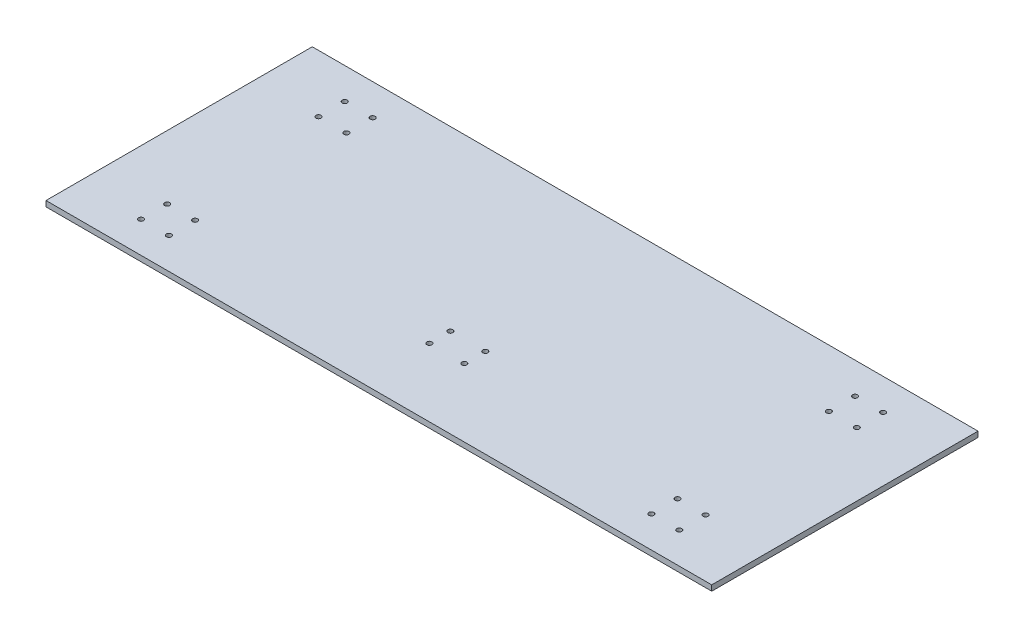
ISO-10303-21;
HEADER;
FILE_DESCRIPTION(('STEP AP214'),'2;1');
FILE_NAME('part.step','',(''),(''),'','','');
FILE_SCHEMA(('AUTOMOTIVE_DESIGN { 1 0 10303 214 1 1 1 1 }'));
ENDSEC;
DATA;
#1=APPLICATION_CONTEXT('core data for automotive mechanical design processes');
#2=APPLICATION_PROTOCOL_DEFINITION('international standard','automotive_design',2000,#1);
#3=PRODUCT_CONTEXT('',#1,'mechanical');
#4=PRODUCT('Part','Part','',(#3));
#5=PRODUCT_RELATED_PRODUCT_CATEGORY('part','',(#4));
#6=PRODUCT_DEFINITION_FORMATION('','',#4);
#7=PRODUCT_DEFINITION_CONTEXT('part definition',#1,'design');
#8=PRODUCT_DEFINITION('design','',#6,#7);
#9=PRODUCT_DEFINITION_SHAPE('','',#8);
#10=(LENGTH_UNIT() NAMED_UNIT(*) SI_UNIT(.MILLI.,.METRE.));
#11=(NAMED_UNIT(*) PLANE_ANGLE_UNIT() SI_UNIT($,.RADIAN.));
#12=(NAMED_UNIT(*) SI_UNIT($,.STERADIAN.) SOLID_ANGLE_UNIT());
#13=UNCERTAINTY_MEASURE_WITH_UNIT(LENGTH_MEASURE(1.E-05),#10,'distance_accuracy_value','');
#14=(GEOMETRIC_REPRESENTATION_CONTEXT(3) GLOBAL_UNCERTAINTY_ASSIGNED_CONTEXT((#13)) GLOBAL_UNIT_ASSIGNED_CONTEXT((#10,
#11,#12)) REPRESENTATION_CONTEXT('',''));
#15=CARTESIAN_POINT('',(0.,0.,0.));
#16=DIRECTION('',(0.,0.,1.));
#17=DIRECTION('',(1.,0.,0.));
#18=AXIS2_PLACEMENT_3D('',#15,#16,#17);
#19=CARTESIAN_POINT('',(381.,6.35,-152.4));
#20=DIRECTION('',(-1.,0.,0.));
#21=DIRECTION('',(0.,0.,1.));
#22=AXIS2_PLACEMENT_3D('',#19,#20,#21);
#23=PLANE('',#22);
#24=DIRECTION('',(0.,0.,-1.));
#25=VECTOR('',#24,1.);
#26=CARTESIAN_POINT('',(381.,0.,-152.4));
#27=LINE('',#26,#25);
#28=CARTESIAN_POINT('',(381.,0.,152.4));
#29=VERTEX_POINT('',#28);
#30=CARTESIAN_POINT('',(381.,0.,-152.4));
#31=VERTEX_POINT('',#30);
#32=EDGE_CURVE('E98',#29,#31,#27,.T.);
#33=ORIENTED_EDGE('',*,*,#32,.T.);
#34=DIRECTION('',(0.,-1.,0.));
#35=VECTOR('',#34,1.);
#36=CARTESIAN_POINT('',(381.,6.35,-152.4));
#37=LINE('',#36,#35);
#38=CARTESIAN_POINT('',(381.,6.35,-152.4));
#39=VERTEX_POINT('',#38);
#40=EDGE_CURVE('E11',#39,#31,#37,.T.);
#41=ORIENTED_EDGE('',*,*,#40,.F.);
#42=DIRECTION('',(0.,0.,-1.));
#43=VECTOR('',#42,1.);
#44=CARTESIAN_POINT('',(381.,6.35,-152.4));
#45=LINE('',#44,#43);
#46=CARTESIAN_POINT('',(381.,6.35,152.4));
#47=VERTEX_POINT('',#46);
#48=EDGE_CURVE('E86',#47,#39,#45,.T.);
#49=ORIENTED_EDGE('',*,*,#48,.F.);
#50=DIRECTION('',(0.,-1.,0.));
#51=VECTOR('',#50,1.);
#52=CARTESIAN_POINT('',(381.,6.35,152.4));
#53=LINE('',#52,#51);
#54=EDGE_CURVE('E94',#47,#29,#53,.T.);
#55=ORIENTED_EDGE('',*,*,#54,.T.);
#56=EDGE_LOOP('',(#33,#41,#49,#55));
#57=FACE_BOUND('',#56,.T.);
#58=ADVANCED_FACE('F35',(#57),#23,.F.);
#59=CARTESIAN_POINT('',(-381.,6.35,-152.4));
#60=DIRECTION('',(0.,0.,1.));
#61=DIRECTION('',(1.,0.,0.));
#62=AXIS2_PLACEMENT_3D('',#59,#60,#61);
#63=PLANE('',#62);
#64=DIRECTION('',(-1.,0.,0.));
#65=VECTOR('',#64,1.);
#66=CARTESIAN_POINT('',(-381.,0.,-152.4));
#67=LINE('',#66,#65);
#68=CARTESIAN_POINT('',(-381.,0.,-152.4));
#69=VERTEX_POINT('',#68);
#70=EDGE_CURVE('E90',#31,#69,#67,.T.);
#71=ORIENTED_EDGE('',*,*,#70,.T.);
#72=DIRECTION('',(0.,-1.,0.));
#73=VECTOR('',#72,1.);
#74=CARTESIAN_POINT('',(-381.,6.35,-152.4));
#75=LINE('',#74,#73);
#76=CARTESIAN_POINT('',(-381.,6.35,-152.4));
#77=VERTEX_POINT('',#76);
#78=EDGE_CURVE('E43',#77,#69,#75,.T.);
#79=ORIENTED_EDGE('',*,*,#78,.F.);
#80=DIRECTION('',(-1.,0.,0.));
#81=VECTOR('',#80,1.);
#82=CARTESIAN_POINT('',(-381.,6.35,-152.4));
#83=LINE('',#82,#81);
#84=EDGE_CURVE('E81',#39,#77,#83,.T.);
#85=ORIENTED_EDGE('',*,*,#84,.F.);
#86=ORIENTED_EDGE('',*,*,#40,.T.);
#87=EDGE_LOOP('',(#71,#79,#85,#86));
#88=FACE_BOUND('',#87,.T.);
#89=ADVANCED_FACE('F89',(#88),#63,.F.);
#90=CARTESIAN_POINT('',(-381.,6.35,-152.4));
#91=DIRECTION('',(1.,0.,0.));
#92=DIRECTION('',(0.,0.,-1.));
#93=AXIS2_PLACEMENT_3D('',#90,#91,#92);
#94=PLANE('',#93);
#95=DIRECTION('',(0.,0.,1.));
#96=VECTOR('',#95,1.);
#97=CARTESIAN_POINT('',(-381.,0.,-152.4));
#98=LINE('',#97,#96);
#99=CARTESIAN_POINT('',(-381.,0.,152.4));
#100=VERTEX_POINT('',#99);
#101=EDGE_CURVE('E68',#69,#100,#98,.T.);
#102=ORIENTED_EDGE('',*,*,#101,.T.);
#103=DIRECTION('',(0.,-1.,0.));
#104=VECTOR('',#103,1.);
#105=CARTESIAN_POINT('',(-381.,6.35,152.4));
#106=LINE('',#105,#104);
#107=CARTESIAN_POINT('',(-381.,6.35,152.4));
#108=VERTEX_POINT('',#107);
#109=EDGE_CURVE('E91',#108,#100,#106,.T.);
#110=ORIENTED_EDGE('',*,*,#109,.F.);
#111=DIRECTION('',(0.,0.,1.));
#112=VECTOR('',#111,1.);
#113=CARTESIAN_POINT('',(-381.,6.35,-152.4));
#114=LINE('',#113,#112);
#115=EDGE_CURVE('E84',#77,#108,#114,.T.);
#116=ORIENTED_EDGE('',*,*,#115,.F.);
#117=ORIENTED_EDGE('',*,*,#78,.T.);
#118=EDGE_LOOP('',(#102,#110,#116,#117));
#119=FACE_BOUND('',#118,.T.);
#120=ADVANCED_FACE('F92',(#119),#94,.F.);
#121=CARTESIAN_POINT('',(-381.,6.35,152.4));
#122=DIRECTION('',(0.,0.,-1.));
#123=DIRECTION('',(-1.,0.,0.));
#124=AXIS2_PLACEMENT_3D('',#121,#122,#123);
#125=PLANE('',#124);
#126=DIRECTION('',(1.,0.,0.));
#127=VECTOR('',#126,1.);
#128=CARTESIAN_POINT('',(-381.,0.,152.4));
#129=LINE('',#128,#127);
#130=EDGE_CURVE('E74',#100,#29,#129,.T.);
#131=ORIENTED_EDGE('',*,*,#130,.T.);
#132=ORIENTED_EDGE('',*,*,#54,.F.);
#133=DIRECTION('',(1.,0.,0.));
#134=VECTOR('',#133,1.);
#135=CARTESIAN_POINT('',(-381.,6.35,152.4));
#136=LINE('',#135,#134);
#137=EDGE_CURVE('E51',#108,#47,#136,.T.);
#138=ORIENTED_EDGE('',*,*,#137,.F.);
#139=ORIENTED_EDGE('',*,*,#109,.T.);
#140=EDGE_LOOP('',(#131,#132,#138,#139));
#141=FACE_BOUND('',#140,.T.);
#142=ADVANCED_FACE('F106',(#141),#125,.F.);
#143=CARTESIAN_POINT('',(0.,6.35,0.));
#144=DIRECTION('',(0.,1.,0.));
#145=DIRECTION('',(0.,0.,1.));
#146=AXIS2_PLACEMENT_3D('',#143,#144,#145);
#147=PLANE('',#146);
#148=CARTESIAN_POINT('',(276.100000000858,6.35,-116.6));
#149=DIRECTION('',(0.,1.,0.));
#150=DIRECTION('',(0.,0.,1.));
#151=AXIS2_PLACEMENT_3D('',#148,#149,#150);
#152=CIRCLE('',#151,2.90000000000001);
#153=CARTESIAN_POINT('',(276.100000000858,6.35,-113.7));
#154=VERTEX_POINT('',#153);
#155=EDGE_CURVE('E228',#154,#154,#152,.T.);
#156=ORIENTED_EDGE('',*,*,#155,.F.);
#157=EDGE_LOOP('',(#156));
#158=FACE_BOUND('',#157,.T.);
#159=CARTESIAN_POINT('',(276.100000000858,6.35,-86.6000000000002));
#160=DIRECTION('',(0.,1.,0.));
#161=DIRECTION('',(0.,0.,1.));
#162=AXIS2_PLACEMENT_3D('',#159,#160,#161);
#163=CIRCLE('',#162,2.90000000000001);
#164=CARTESIAN_POINT('',(276.100000000858,6.35,-83.7000000000001));
#165=VERTEX_POINT('',#164);
#166=EDGE_CURVE('E222',#165,#165,#163,.T.);
#167=ORIENTED_EDGE('',*,*,#166,.F.);
#168=EDGE_LOOP('',(#167));
#169=FACE_BOUND('',#168,.T.);
#170=CARTESIAN_POINT('',(308.100000000858,6.35,-116.6));
#171=DIRECTION('',(0.,1.,0.));
#172=DIRECTION('',(0.,0.,1.));
#173=AXIS2_PLACEMENT_3D('',#170,#171,#172);
#174=CIRCLE('',#173,2.90000000000001);
#175=CARTESIAN_POINT('',(308.100000000858,6.35,-113.7));
#176=VERTEX_POINT('',#175);
#177=EDGE_CURVE('E216',#176,#176,#174,.T.);
#178=ORIENTED_EDGE('',*,*,#177,.F.);
#179=EDGE_LOOP('',(#178));
#180=FACE_BOUND('',#179,.T.);
#181=CARTESIAN_POINT('',(308.100000000858,6.35,-86.6000000000002));
#182=DIRECTION('',(0.,1.,0.));
#183=DIRECTION('',(0.,0.,1.));
#184=AXIS2_PLACEMENT_3D('',#181,#182,#183);
#185=CIRCLE('',#184,2.90000000000001);
#186=CARTESIAN_POINT('',(308.100000000858,6.35,-83.7000000000001));
#187=VERTEX_POINT('',#186);
#188=EDGE_CURVE('E210',#187,#187,#185,.T.);
#189=ORIENTED_EDGE('',*,*,#188,.F.);
#190=EDGE_LOOP('',(#189));
#191=FACE_BOUND('',#190,.T.);
#192=CARTESIAN_POINT('',(276.100000000858,6.35,86.5999999999998));
#193=DIRECTION('',(0.,1.,0.));
#194=DIRECTION('',(0.,0.,1.));
#195=AXIS2_PLACEMENT_3D('',#192,#193,#194);
#196=CIRCLE('',#195,2.90000000000001);
#197=CARTESIAN_POINT('',(276.100000000858,6.35,89.4999999999998));
#198=VERTEX_POINT('',#197);
#199=EDGE_CURVE('E204',#198,#198,#196,.T.);
#200=ORIENTED_EDGE('',*,*,#199,.F.);
#201=EDGE_LOOP('',(#200));
#202=FACE_BOUND('',#201,.T.);
#203=CARTESIAN_POINT('',(276.100000000858,6.35,116.6));
#204=DIRECTION('',(0.,1.,0.));
#205=DIRECTION('',(0.,0.,1.));
#206=AXIS2_PLACEMENT_3D('',#203,#204,#205);
#207=CIRCLE('',#206,2.90000000000001);
#208=CARTESIAN_POINT('',(276.100000000858,6.35,119.5));
#209=VERTEX_POINT('',#208);
#210=EDGE_CURVE('E198',#209,#209,#207,.T.);
#211=ORIENTED_EDGE('',*,*,#210,.F.);
#212=EDGE_LOOP('',(#211));
#213=FACE_BOUND('',#212,.T.);
#214=CARTESIAN_POINT('',(308.100000000858,6.35,86.5999999999998));
#215=DIRECTION('',(0.,1.,0.));
#216=DIRECTION('',(0.,0.,1.));
#217=AXIS2_PLACEMENT_3D('',#214,#215,#216);
#218=CIRCLE('',#217,2.90000000000001);
#219=CARTESIAN_POINT('',(308.100000000858,6.35,89.4999999999998));
#220=VERTEX_POINT('',#219);
#221=EDGE_CURVE('E192',#220,#220,#218,.T.);
#222=ORIENTED_EDGE('',*,*,#221,.F.);
#223=EDGE_LOOP('',(#222));
#224=FACE_BOUND('',#223,.T.);
#225=CARTESIAN_POINT('',(308.100000000858,6.35,116.6));
#226=DIRECTION('',(0.,1.,0.));
#227=DIRECTION('',(0.,0.,1.));
#228=AXIS2_PLACEMENT_3D('',#225,#226,#227);
#229=CIRCLE('',#228,2.90000000000001);
#230=CARTESIAN_POINT('',(308.100000000858,6.35,119.5));
#231=VERTEX_POINT('',#230);
#232=EDGE_CURVE('E186',#231,#231,#229,.T.);
#233=ORIENTED_EDGE('',*,*,#232,.F.);
#234=EDGE_LOOP('',(#233));
#235=FACE_BOUND('',#234,.T.);
#236=CARTESIAN_POINT('',(-308.100000000858,6.35,-116.6));
#237=DIRECTION('',(0.,1.,0.));
#238=DIRECTION('',(0.,0.,1.));
#239=AXIS2_PLACEMENT_3D('',#236,#237,#238);
#240=CIRCLE('',#239,2.90000000000001);
#241=CARTESIAN_POINT('',(-308.100000000858,6.35,-113.7));
#242=VERTEX_POINT('',#241);
#243=EDGE_CURVE('E180',#242,#242,#240,.T.);
#244=ORIENTED_EDGE('',*,*,#243,.F.);
#245=EDGE_LOOP('',(#244));
#246=FACE_BOUND('',#245,.T.);
#247=CARTESIAN_POINT('',(-308.100000000858,6.35,-86.6000000000001));
#248=DIRECTION('',(0.,1.,0.));
#249=DIRECTION('',(0.,0.,1.));
#250=AXIS2_PLACEMENT_3D('',#247,#248,#249);
#251=CIRCLE('',#250,2.90000000000001);
#252=CARTESIAN_POINT('',(-308.100000000858,6.35,-83.7000000000001));
#253=VERTEX_POINT('',#252);
#254=EDGE_CURVE('E174',#253,#253,#251,.T.);
#255=ORIENTED_EDGE('',*,*,#254,.F.);
#256=EDGE_LOOP('',(#255));
#257=FACE_BOUND('',#256,.T.);
#258=CARTESIAN_POINT('',(-276.100000000858,6.35,-116.6));
#259=DIRECTION('',(0.,1.,0.));
#260=DIRECTION('',(0.,0.,1.));
#261=AXIS2_PLACEMENT_3D('',#258,#259,#260);
#262=CIRCLE('',#261,2.90000000000001);
#263=CARTESIAN_POINT('',(-276.100000000858,6.35,-113.7));
#264=VERTEX_POINT('',#263);
#265=EDGE_CURVE('E168',#264,#264,#262,.T.);
#266=ORIENTED_EDGE('',*,*,#265,.F.);
#267=EDGE_LOOP('',(#266));
#268=FACE_BOUND('',#267,.T.);
#269=CARTESIAN_POINT('',(-276.100000000858,6.35,-86.6000000000001));
#270=DIRECTION('',(0.,1.,0.));
#271=DIRECTION('',(0.,0.,1.));
#272=AXIS2_PLACEMENT_3D('',#269,#270,#271);
#273=CIRCLE('',#272,2.90000000000001);
#274=CARTESIAN_POINT('',(-276.100000000858,6.35,-83.7000000000001));
#275=VERTEX_POINT('',#274);
#276=EDGE_CURVE('E162',#275,#275,#273,.T.);
#277=ORIENTED_EDGE('',*,*,#276,.F.);
#278=EDGE_LOOP('',(#277));
#279=FACE_BOUND('',#278,.T.);
#280=CARTESIAN_POINT('',(-276.100000000858,6.35,86.5999999999999));
#281=DIRECTION('',(0.,1.,0.));
#282=DIRECTION('',(0.,0.,1.));
#283=AXIS2_PLACEMENT_3D('',#280,#281,#282);
#284=CIRCLE('',#283,2.90000000000001);
#285=CARTESIAN_POINT('',(-276.100000000858,6.35,89.4999999999999));
#286=VERTEX_POINT('',#285);
#287=EDGE_CURVE('E156',#286,#286,#284,.T.);
#288=ORIENTED_EDGE('',*,*,#287,.F.);
#289=EDGE_LOOP('',(#288));
#290=FACE_BOUND('',#289,.T.);
#291=CARTESIAN_POINT('',(-276.100000000858,6.35,116.6));
#292=DIRECTION('',(0.,1.,0.));
#293=DIRECTION('',(0.,0.,1.));
#294=AXIS2_PLACEMENT_3D('',#291,#292,#293);
#295=CIRCLE('',#294,2.90000000000001);
#296=CARTESIAN_POINT('',(-276.100000000858,6.35,119.5));
#297=VERTEX_POINT('',#296);
#298=EDGE_CURVE('E150',#297,#297,#295,.T.);
#299=ORIENTED_EDGE('',*,*,#298,.F.);
#300=EDGE_LOOP('',(#299));
#301=FACE_BOUND('',#300,.T.);
#302=CARTESIAN_POINT('',(-308.100000000858,6.35,116.6));
#303=DIRECTION('',(0.,1.,0.));
#304=DIRECTION('',(0.,0.,1.));
#305=AXIS2_PLACEMENT_3D('',#302,#303,#304);
#306=CIRCLE('',#305,2.90000000000001);
#307=CARTESIAN_POINT('',(-308.100000000858,6.35,119.5));
#308=VERTEX_POINT('',#307);
#309=EDGE_CURVE('E144',#308,#308,#306,.T.);
#310=ORIENTED_EDGE('',*,*,#309,.F.);
#311=EDGE_LOOP('',(#310));
#312=FACE_BOUND('',#311,.T.);
#313=CARTESIAN_POINT('',(-308.100000000858,6.35,86.5999999999999));
#314=DIRECTION('',(0.,1.,0.));
#315=DIRECTION('',(0.,0.,1.));
#316=AXIS2_PLACEMENT_3D('',#313,#314,#315);
#317=CIRCLE('',#316,2.90000000000001);
#318=CARTESIAN_POINT('',(-308.100000000858,6.35,89.4999999999999));
#319=VERTEX_POINT('',#318);
#320=EDGE_CURVE('E138',#319,#319,#317,.T.);
#321=ORIENTED_EDGE('',*,*,#320,.F.);
#322=EDGE_LOOP('',(#321));
#323=FACE_BOUND('',#322,.T.);
#324=CARTESIAN_POINT('',(20.0000000254473,6.35,50.5499999999999));
#325=DIRECTION('',(0.,1.,0.));
#326=DIRECTION('',(0.,0.,1.));
#327=AXIS2_PLACEMENT_3D('',#324,#325,#326);
#328=CIRCLE('',#327,2.9);
#329=CARTESIAN_POINT('',(20.0000000254473,6.35,53.4499999999999));
#330=VERTEX_POINT('',#329);
#331=EDGE_CURVE('E132',#330,#330,#328,.T.);
#332=ORIENTED_EDGE('',*,*,#331,.F.);
#333=EDGE_LOOP('',(#332));
#334=FACE_BOUND('',#333,.T.);
#335=CARTESIAN_POINT('',(20.0000000254473,6.35,74.5499999999999));
#336=DIRECTION('',(0.,1.,0.));
#337=DIRECTION('',(0.,0.,1.));
#338=AXIS2_PLACEMENT_3D('',#335,#336,#337);
#339=CIRCLE('',#338,2.9);
#340=CARTESIAN_POINT('',(20.0000000254473,6.35,77.4499999999999));
#341=VERTEX_POINT('',#340);
#342=EDGE_CURVE('E126',#341,#341,#339,.T.);
#343=ORIENTED_EDGE('',*,*,#342,.F.);
#344=EDGE_LOOP('',(#343));
#345=FACE_BOUND('',#344,.T.);
#346=CARTESIAN_POINT('',(-19.9999999745527,6.35,74.5499999999999));
#347=DIRECTION('',(0.,1.,0.));
#348=DIRECTION('',(0.,0.,1.));
#349=AXIS2_PLACEMENT_3D('',#346,#347,#348);
#350=CIRCLE('',#349,2.9);
#351=CARTESIAN_POINT('',(-19.9999999745527,6.35,77.4499999999999));
#352=VERTEX_POINT('',#351);
#353=EDGE_CURVE('E120',#352,#352,#350,.T.);
#354=ORIENTED_EDGE('',*,*,#353,.F.);
#355=EDGE_LOOP('',(#354));
#356=FACE_BOUND('',#355,.T.);
#357=CARTESIAN_POINT('',(-19.9999999745527,6.35,50.5499999999999));
#358=DIRECTION('',(0.,1.,0.));
#359=DIRECTION('',(0.,0.,1.));
#360=AXIS2_PLACEMENT_3D('',#357,#358,#359);
#361=CIRCLE('',#360,2.9);
#362=CARTESIAN_POINT('',(-19.9999999745527,6.35,53.4499999999999));
#363=VERTEX_POINT('',#362);
#364=EDGE_CURVE('E114',#363,#363,#361,.T.);
#365=ORIENTED_EDGE('',*,*,#364,.F.);
#366=EDGE_LOOP('',(#365));
#367=FACE_BOUND('',#366,.T.);
#368=ORIENTED_EDGE('',*,*,#48,.T.);
#369=ORIENTED_EDGE('',*,*,#84,.T.);
#370=ORIENTED_EDGE('',*,*,#115,.T.);
#371=ORIENTED_EDGE('',*,*,#137,.T.);
#372=EDGE_LOOP('',(#368,#369,#370,#371));
#373=FACE_BOUND('',#372,.T.);
#374=ADVANCED_FACE('F82',(#158,#169,#180,#191,#202,#213,#224,#235,#246,#257,#268,#279,#290,#301,
#312,#323,#334,#345,#356,#367,#373),#147,.T.);
#375=CARTESIAN_POINT('',(0.,0.,0.));
#376=DIRECTION('',(0.,1.,0.));
#377=DIRECTION('',(0.,0.,1.));
#378=AXIS2_PLACEMENT_3D('',#375,#376,#377);
#379=PLANE('',#378);
#380=CARTESIAN_POINT('',(276.100000000858,0.,-116.6));
#381=DIRECTION('',(0.,1.,0.));
#382=DIRECTION('',(0.,0.,1.));
#383=AXIS2_PLACEMENT_3D('',#380,#381,#382);
#384=CIRCLE('',#383,2.90000000000001);
#385=CARTESIAN_POINT('',(276.100000000858,0.,-113.7));
#386=VERTEX_POINT('',#385);
#387=EDGE_CURVE('E225',#386,#386,#384,.T.);
#388=ORIENTED_EDGE('',*,*,#387,.T.);
#389=EDGE_LOOP('',(#388));
#390=FACE_BOUND('',#389,.T.);
#391=CARTESIAN_POINT('',(276.100000000858,0.,-86.6000000000002));
#392=DIRECTION('',(0.,1.,0.));
#393=DIRECTION('',(0.,0.,1.));
#394=AXIS2_PLACEMENT_3D('',#391,#392,#393);
#395=CIRCLE('',#394,2.90000000000001);
#396=CARTESIAN_POINT('',(276.100000000858,0.,-83.7000000000001));
#397=VERTEX_POINT('',#396);
#398=EDGE_CURVE('E219',#397,#397,#395,.T.);
#399=ORIENTED_EDGE('',*,*,#398,.T.);
#400=EDGE_LOOP('',(#399));
#401=FACE_BOUND('',#400,.T.);
#402=CARTESIAN_POINT('',(308.100000000858,0.,-116.6));
#403=DIRECTION('',(0.,1.,0.));
#404=DIRECTION('',(0.,0.,1.));
#405=AXIS2_PLACEMENT_3D('',#402,#403,#404);
#406=CIRCLE('',#405,2.90000000000001);
#407=CARTESIAN_POINT('',(308.100000000858,0.,-113.7));
#408=VERTEX_POINT('',#407);
#409=EDGE_CURVE('E213',#408,#408,#406,.T.);
#410=ORIENTED_EDGE('',*,*,#409,.T.);
#411=EDGE_LOOP('',(#410));
#412=FACE_BOUND('',#411,.T.);
#413=CARTESIAN_POINT('',(308.100000000858,0.,-86.6000000000002));
#414=DIRECTION('',(0.,1.,0.));
#415=DIRECTION('',(0.,0.,1.));
#416=AXIS2_PLACEMENT_3D('',#413,#414,#415);
#417=CIRCLE('',#416,2.90000000000001);
#418=CARTESIAN_POINT('',(308.100000000858,0.,-83.7000000000001));
#419=VERTEX_POINT('',#418);
#420=EDGE_CURVE('E207',#419,#419,#417,.T.);
#421=ORIENTED_EDGE('',*,*,#420,.T.);
#422=EDGE_LOOP('',(#421));
#423=FACE_BOUND('',#422,.T.);
#424=CARTESIAN_POINT('',(276.100000000858,0.,86.5999999999998));
#425=DIRECTION('',(0.,1.,0.));
#426=DIRECTION('',(0.,0.,1.));
#427=AXIS2_PLACEMENT_3D('',#424,#425,#426);
#428=CIRCLE('',#427,2.90000000000001);
#429=CARTESIAN_POINT('',(276.100000000858,0.,89.4999999999998));
#430=VERTEX_POINT('',#429);
#431=EDGE_CURVE('E201',#430,#430,#428,.T.);
#432=ORIENTED_EDGE('',*,*,#431,.T.);
#433=EDGE_LOOP('',(#432));
#434=FACE_BOUND('',#433,.T.);
#435=CARTESIAN_POINT('',(276.100000000858,0.,116.6));
#436=DIRECTION('',(0.,1.,0.));
#437=DIRECTION('',(0.,0.,1.));
#438=AXIS2_PLACEMENT_3D('',#435,#436,#437);
#439=CIRCLE('',#438,2.90000000000001);
#440=CARTESIAN_POINT('',(276.100000000858,0.,119.5));
#441=VERTEX_POINT('',#440);
#442=EDGE_CURVE('E195',#441,#441,#439,.T.);
#443=ORIENTED_EDGE('',*,*,#442,.T.);
#444=EDGE_LOOP('',(#443));
#445=FACE_BOUND('',#444,.T.);
#446=CARTESIAN_POINT('',(308.100000000858,0.,86.5999999999998));
#447=DIRECTION('',(0.,1.,0.));
#448=DIRECTION('',(0.,0.,1.));
#449=AXIS2_PLACEMENT_3D('',#446,#447,#448);
#450=CIRCLE('',#449,2.90000000000001);
#451=CARTESIAN_POINT('',(308.100000000858,0.,89.4999999999998));
#452=VERTEX_POINT('',#451);
#453=EDGE_CURVE('E189',#452,#452,#450,.T.);
#454=ORIENTED_EDGE('',*,*,#453,.T.);
#455=EDGE_LOOP('',(#454));
#456=FACE_BOUND('',#455,.T.);
#457=CARTESIAN_POINT('',(308.100000000858,0.,116.6));
#458=DIRECTION('',(0.,1.,0.));
#459=DIRECTION('',(0.,0.,1.));
#460=AXIS2_PLACEMENT_3D('',#457,#458,#459);
#461=CIRCLE('',#460,2.90000000000001);
#462=CARTESIAN_POINT('',(308.100000000858,0.,119.5));
#463=VERTEX_POINT('',#462);
#464=EDGE_CURVE('E183',#463,#463,#461,.T.);
#465=ORIENTED_EDGE('',*,*,#464,.T.);
#466=EDGE_LOOP('',(#465));
#467=FACE_BOUND('',#466,.T.);
#468=CARTESIAN_POINT('',(-308.100000000858,0.,-116.6));
#469=DIRECTION('',(0.,1.,0.));
#470=DIRECTION('',(0.,0.,1.));
#471=AXIS2_PLACEMENT_3D('',#468,#469,#470);
#472=CIRCLE('',#471,2.90000000000001);
#473=CARTESIAN_POINT('',(-308.100000000858,0.,-113.7));
#474=VERTEX_POINT('',#473);
#475=EDGE_CURVE('E177',#474,#474,#472,.T.);
#476=ORIENTED_EDGE('',*,*,#475,.T.);
#477=EDGE_LOOP('',(#476));
#478=FACE_BOUND('',#477,.T.);
#479=CARTESIAN_POINT('',(-308.100000000858,0.,-86.6000000000001));
#480=DIRECTION('',(0.,1.,0.));
#481=DIRECTION('',(0.,0.,1.));
#482=AXIS2_PLACEMENT_3D('',#479,#480,#481);
#483=CIRCLE('',#482,2.90000000000001);
#484=CARTESIAN_POINT('',(-308.100000000858,0.,-83.7000000000001));
#485=VERTEX_POINT('',#484);
#486=EDGE_CURVE('E171',#485,#485,#483,.T.);
#487=ORIENTED_EDGE('',*,*,#486,.T.);
#488=EDGE_LOOP('',(#487));
#489=FACE_BOUND('',#488,.T.);
#490=CARTESIAN_POINT('',(-276.100000000858,0.,-116.6));
#491=DIRECTION('',(0.,1.,0.));
#492=DIRECTION('',(0.,0.,1.));
#493=AXIS2_PLACEMENT_3D('',#490,#491,#492);
#494=CIRCLE('',#493,2.90000000000001);
#495=CARTESIAN_POINT('',(-276.100000000858,0.,-113.7));
#496=VERTEX_POINT('',#495);
#497=EDGE_CURVE('E165',#496,#496,#494,.T.);
#498=ORIENTED_EDGE('',*,*,#497,.T.);
#499=EDGE_LOOP('',(#498));
#500=FACE_BOUND('',#499,.T.);
#501=CARTESIAN_POINT('',(-276.100000000858,0.,-86.6000000000001));
#502=DIRECTION('',(0.,1.,0.));
#503=DIRECTION('',(0.,0.,1.));
#504=AXIS2_PLACEMENT_3D('',#501,#502,#503);
#505=CIRCLE('',#504,2.90000000000001);
#506=CARTESIAN_POINT('',(-276.100000000858,0.,-83.7000000000001));
#507=VERTEX_POINT('',#506);
#508=EDGE_CURVE('E159',#507,#507,#505,.T.);
#509=ORIENTED_EDGE('',*,*,#508,.T.);
#510=EDGE_LOOP('',(#509));
#511=FACE_BOUND('',#510,.T.);
#512=CARTESIAN_POINT('',(-276.100000000858,0.,86.5999999999999));
#513=DIRECTION('',(0.,1.,0.));
#514=DIRECTION('',(0.,0.,1.));
#515=AXIS2_PLACEMENT_3D('',#512,#513,#514);
#516=CIRCLE('',#515,2.90000000000001);
#517=CARTESIAN_POINT('',(-276.100000000858,0.,89.4999999999999));
#518=VERTEX_POINT('',#517);
#519=EDGE_CURVE('E153',#518,#518,#516,.T.);
#520=ORIENTED_EDGE('',*,*,#519,.T.);
#521=EDGE_LOOP('',(#520));
#522=FACE_BOUND('',#521,.T.);
#523=CARTESIAN_POINT('',(-276.100000000858,0.,116.6));
#524=DIRECTION('',(0.,1.,0.));
#525=DIRECTION('',(0.,0.,1.));
#526=AXIS2_PLACEMENT_3D('',#523,#524,#525);
#527=CIRCLE('',#526,2.90000000000001);
#528=CARTESIAN_POINT('',(-276.100000000858,0.,119.5));
#529=VERTEX_POINT('',#528);
#530=EDGE_CURVE('E147',#529,#529,#527,.T.);
#531=ORIENTED_EDGE('',*,*,#530,.T.);
#532=EDGE_LOOP('',(#531));
#533=FACE_BOUND('',#532,.T.);
#534=CARTESIAN_POINT('',(-308.100000000858,0.,116.6));
#535=DIRECTION('',(0.,1.,0.));
#536=DIRECTION('',(0.,0.,1.));
#537=AXIS2_PLACEMENT_3D('',#534,#535,#536);
#538=CIRCLE('',#537,2.90000000000001);
#539=CARTESIAN_POINT('',(-308.100000000858,0.,119.5));
#540=VERTEX_POINT('',#539);
#541=EDGE_CURVE('E141',#540,#540,#538,.T.);
#542=ORIENTED_EDGE('',*,*,#541,.T.);
#543=EDGE_LOOP('',(#542));
#544=FACE_BOUND('',#543,.T.);
#545=CARTESIAN_POINT('',(-308.100000000858,0.,86.5999999999999));
#546=DIRECTION('',(0.,1.,0.));
#547=DIRECTION('',(0.,0.,1.));
#548=AXIS2_PLACEMENT_3D('',#545,#546,#547);
#549=CIRCLE('',#548,2.90000000000001);
#550=CARTESIAN_POINT('',(-308.100000000858,0.,89.4999999999999));
#551=VERTEX_POINT('',#550);
#552=EDGE_CURVE('E135',#551,#551,#549,.T.);
#553=ORIENTED_EDGE('',*,*,#552,.T.);
#554=EDGE_LOOP('',(#553));
#555=FACE_BOUND('',#554,.T.);
#556=CARTESIAN_POINT('',(20.0000000254473,0.,50.5499999999999));
#557=DIRECTION('',(0.,1.,0.));
#558=DIRECTION('',(0.,0.,1.));
#559=AXIS2_PLACEMENT_3D('',#556,#557,#558);
#560=CIRCLE('',#559,2.9);
#561=CARTESIAN_POINT('',(20.0000000254473,0.,53.4499999999999));
#562=VERTEX_POINT('',#561);
#563=EDGE_CURVE('E129',#562,#562,#560,.T.);
#564=ORIENTED_EDGE('',*,*,#563,.T.);
#565=EDGE_LOOP('',(#564));
#566=FACE_BOUND('',#565,.T.);
#567=CARTESIAN_POINT('',(20.0000000254473,0.,74.5499999999999));
#568=DIRECTION('',(0.,1.,0.));
#569=DIRECTION('',(0.,0.,1.));
#570=AXIS2_PLACEMENT_3D('',#567,#568,#569);
#571=CIRCLE('',#570,2.9);
#572=CARTESIAN_POINT('',(20.0000000254473,0.,77.4499999999999));
#573=VERTEX_POINT('',#572);
#574=EDGE_CURVE('E123',#573,#573,#571,.T.);
#575=ORIENTED_EDGE('',*,*,#574,.T.);
#576=EDGE_LOOP('',(#575));
#577=FACE_BOUND('',#576,.T.);
#578=CARTESIAN_POINT('',(-19.9999999745527,0.,74.5499999999999));
#579=DIRECTION('',(0.,1.,0.));
#580=DIRECTION('',(0.,0.,1.));
#581=AXIS2_PLACEMENT_3D('',#578,#579,#580);
#582=CIRCLE('',#581,2.9);
#583=CARTESIAN_POINT('',(-19.9999999745527,0.,77.4499999999999));
#584=VERTEX_POINT('',#583);
#585=EDGE_CURVE('E117',#584,#584,#582,.T.);
#586=ORIENTED_EDGE('',*,*,#585,.T.);
#587=EDGE_LOOP('',(#586));
#588=FACE_BOUND('',#587,.T.);
#589=CARTESIAN_POINT('',(-19.9999999745527,0.,50.5499999999999));
#590=DIRECTION('',(0.,1.,0.));
#591=DIRECTION('',(0.,0.,1.));
#592=AXIS2_PLACEMENT_3D('',#589,#590,#591);
#593=CIRCLE('',#592,2.9);
#594=CARTESIAN_POINT('',(-19.9999999745527,0.,53.4499999999999));
#595=VERTEX_POINT('',#594);
#596=EDGE_CURVE('E101',#595,#595,#593,.T.);
#597=ORIENTED_EDGE('',*,*,#596,.T.);
#598=EDGE_LOOP('',(#597));
#599=FACE_BOUND('',#598,.T.);
#600=ORIENTED_EDGE('',*,*,#32,.F.);
#601=ORIENTED_EDGE('',*,*,#130,.F.);
#602=ORIENTED_EDGE('',*,*,#101,.F.);
#603=ORIENTED_EDGE('',*,*,#70,.F.);
#604=EDGE_LOOP('',(#600,#601,#602,#603));
#605=FACE_BOUND('',#604,.T.);
#606=ADVANCED_FACE('F109',(#390,#401,#412,#423,#434,#445,#456,#467,#478,#489,#500,#511,#522,
#533,#544,#555,#566,#577,#588,#599,#605),#379,.F.);
#607=CARTESIAN_POINT('',(-19.9999999745527,6.35,50.5499999999999));
#608=DIRECTION('',(0.,1.,0.));
#609=DIRECTION('',(0.,0.,1.));
#610=AXIS2_PLACEMENT_3D('',#607,#608,#609);
#611=CYLINDRICAL_SURFACE('',#610,2.9);
#612=ORIENTED_EDGE('',*,*,#596,.F.);
#613=EDGE_LOOP('',(#612));
#614=FACE_BOUND('',#613,.T.);
#615=ORIENTED_EDGE('',*,*,#364,.T.);
#616=EDGE_LOOP('',(#615));
#617=FACE_BOUND('',#616,.T.);
#618=ADVANCED_FACE('F275',(#614,#617),#611,.F.);
#619=CARTESIAN_POINT('',(-19.9999999745527,6.35,74.5499999999999));
#620=DIRECTION('',(0.,1.,0.));
#621=DIRECTION('',(0.,0.,1.));
#622=AXIS2_PLACEMENT_3D('',#619,#620,#621);
#623=CYLINDRICAL_SURFACE('',#622,2.9);
#624=ORIENTED_EDGE('',*,*,#585,.F.);
#625=EDGE_LOOP('',(#624));
#626=FACE_BOUND('',#625,.T.);
#627=ORIENTED_EDGE('',*,*,#353,.T.);
#628=EDGE_LOOP('',(#627));
#629=FACE_BOUND('',#628,.T.);
#630=ADVANCED_FACE('F277',(#626,#629),#623,.F.);
#631=CARTESIAN_POINT('',(20.0000000254473,6.35,74.5499999999999));
#632=DIRECTION('',(0.,1.,0.));
#633=DIRECTION('',(0.,0.,1.));
#634=AXIS2_PLACEMENT_3D('',#631,#632,#633);
#635=CYLINDRICAL_SURFACE('',#634,2.9);
#636=ORIENTED_EDGE('',*,*,#574,.F.);
#637=EDGE_LOOP('',(#636));
#638=FACE_BOUND('',#637,.T.);
#639=ORIENTED_EDGE('',*,*,#342,.T.);
#640=EDGE_LOOP('',(#639));
#641=FACE_BOUND('',#640,.T.);
#642=ADVANCED_FACE('F284',(#638,#641),#635,.F.);
#643=CARTESIAN_POINT('',(20.0000000254473,6.35,50.5499999999999));
#644=DIRECTION('',(0.,1.,0.));
#645=DIRECTION('',(0.,0.,1.));
#646=AXIS2_PLACEMENT_3D('',#643,#644,#645);
#647=CYLINDRICAL_SURFACE('',#646,2.9);
#648=ORIENTED_EDGE('',*,*,#563,.F.);
#649=EDGE_LOOP('',(#648));
#650=FACE_BOUND('',#649,.T.);
#651=ORIENTED_EDGE('',*,*,#331,.T.);
#652=EDGE_LOOP('',(#651));
#653=FACE_BOUND('',#652,.T.);
#654=ADVANCED_FACE('F331',(#650,#653),#647,.F.);
#655=CARTESIAN_POINT('',(-308.100000000858,6.35,86.5999999999999));
#656=DIRECTION('',(0.,1.,0.));
#657=DIRECTION('',(0.,0.,1.));
#658=AXIS2_PLACEMENT_3D('',#655,#656,#657);
#659=CYLINDRICAL_SURFACE('',#658,2.90000000000001);
#660=ORIENTED_EDGE('',*,*,#552,.F.);
#661=EDGE_LOOP('',(#660));
#662=FACE_BOUND('',#661,.T.);
#663=ORIENTED_EDGE('',*,*,#320,.T.);
#664=EDGE_LOOP('',(#663));
#665=FACE_BOUND('',#664,.T.);
#666=ADVANCED_FACE('F341',(#662,#665),#659,.F.);
#667=CARTESIAN_POINT('',(-308.100000000858,6.35,116.6));
#668=DIRECTION('',(0.,1.,0.));
#669=DIRECTION('',(0.,0.,1.));
#670=AXIS2_PLACEMENT_3D('',#667,#668,#669);
#671=CYLINDRICAL_SURFACE('',#670,2.90000000000001);
#672=ORIENTED_EDGE('',*,*,#541,.F.);
#673=EDGE_LOOP('',(#672));
#674=FACE_BOUND('',#673,.T.);
#675=ORIENTED_EDGE('',*,*,#309,.T.);
#676=EDGE_LOOP('',(#675));
#677=FACE_BOUND('',#676,.T.);
#678=ADVANCED_FACE('F351',(#674,#677),#671,.F.);
#679=CARTESIAN_POINT('',(-276.100000000858,6.35,116.6));
#680=DIRECTION('',(0.,1.,0.));
#681=DIRECTION('',(0.,0.,1.));
#682=AXIS2_PLACEMENT_3D('',#679,#680,#681);
#683=CYLINDRICAL_SURFACE('',#682,2.90000000000001);
#684=ORIENTED_EDGE('',*,*,#530,.F.);
#685=EDGE_LOOP('',(#684));
#686=FACE_BOUND('',#685,.T.);
#687=ORIENTED_EDGE('',*,*,#298,.T.);
#688=EDGE_LOOP('',(#687));
#689=FACE_BOUND('',#688,.T.);
#690=ADVANCED_FACE('F361',(#686,#689),#683,.F.);
#691=CARTESIAN_POINT('',(-276.100000000858,6.35,86.5999999999999));
#692=DIRECTION('',(0.,1.,0.));
#693=DIRECTION('',(0.,0.,1.));
#694=AXIS2_PLACEMENT_3D('',#691,#692,#693);
#695=CYLINDRICAL_SURFACE('',#694,2.90000000000001);
#696=ORIENTED_EDGE('',*,*,#519,.F.);
#697=EDGE_LOOP('',(#696));
#698=FACE_BOUND('',#697,.T.);
#699=ORIENTED_EDGE('',*,*,#287,.T.);
#700=EDGE_LOOP('',(#699));
#701=FACE_BOUND('',#700,.T.);
#702=ADVANCED_FACE('F371',(#698,#701),#695,.F.);
#703=CARTESIAN_POINT('',(-276.100000000858,6.35,-86.6000000000001));
#704=DIRECTION('',(0.,1.,0.));
#705=DIRECTION('',(0.,0.,1.));
#706=AXIS2_PLACEMENT_3D('',#703,#704,#705);
#707=CYLINDRICAL_SURFACE('',#706,2.90000000000001);
#708=ORIENTED_EDGE('',*,*,#508,.F.);
#709=EDGE_LOOP('',(#708));
#710=FACE_BOUND('',#709,.T.);
#711=ORIENTED_EDGE('',*,*,#276,.T.);
#712=EDGE_LOOP('',(#711));
#713=FACE_BOUND('',#712,.T.);
#714=ADVANCED_FACE('F381',(#710,#713),#707,.F.);
#715=CARTESIAN_POINT('',(-276.100000000858,6.35,-116.6));
#716=DIRECTION('',(0.,1.,0.));
#717=DIRECTION('',(0.,0.,1.));
#718=AXIS2_PLACEMENT_3D('',#715,#716,#717);
#719=CYLINDRICAL_SURFACE('',#718,2.90000000000001);
#720=ORIENTED_EDGE('',*,*,#497,.F.);
#721=EDGE_LOOP('',(#720));
#722=FACE_BOUND('',#721,.T.);
#723=ORIENTED_EDGE('',*,*,#265,.T.);
#724=EDGE_LOOP('',(#723));
#725=FACE_BOUND('',#724,.T.);
#726=ADVANCED_FACE('F391',(#722,#725),#719,.F.);
#727=CARTESIAN_POINT('',(-308.100000000858,6.35,-86.6000000000001));
#728=DIRECTION('',(0.,1.,0.));
#729=DIRECTION('',(0.,0.,1.));
#730=AXIS2_PLACEMENT_3D('',#727,#728,#729);
#731=CYLINDRICAL_SURFACE('',#730,2.90000000000001);
#732=ORIENTED_EDGE('',*,*,#486,.F.);
#733=EDGE_LOOP('',(#732));
#734=FACE_BOUND('',#733,.T.);
#735=ORIENTED_EDGE('',*,*,#254,.T.);
#736=EDGE_LOOP('',(#735));
#737=FACE_BOUND('',#736,.T.);
#738=ADVANCED_FACE('F401',(#734,#737),#731,.F.);
#739=CARTESIAN_POINT('',(-308.100000000858,6.35,-116.6));
#740=DIRECTION('',(0.,1.,0.));
#741=DIRECTION('',(0.,0.,1.));
#742=AXIS2_PLACEMENT_3D('',#739,#740,#741);
#743=CYLINDRICAL_SURFACE('',#742,2.90000000000001);
#744=ORIENTED_EDGE('',*,*,#475,.F.);
#745=EDGE_LOOP('',(#744));
#746=FACE_BOUND('',#745,.T.);
#747=ORIENTED_EDGE('',*,*,#243,.T.);
#748=EDGE_LOOP('',(#747));
#749=FACE_BOUND('',#748,.T.);
#750=ADVANCED_FACE('F411',(#746,#749),#743,.F.);
#751=CARTESIAN_POINT('',(308.100000000858,6.35,116.6));
#752=DIRECTION('',(0.,1.,0.));
#753=DIRECTION('',(0.,0.,1.));
#754=AXIS2_PLACEMENT_3D('',#751,#752,#753);
#755=CYLINDRICAL_SURFACE('',#754,2.90000000000001);
#756=ORIENTED_EDGE('',*,*,#464,.F.);
#757=EDGE_LOOP('',(#756));
#758=FACE_BOUND('',#757,.T.);
#759=ORIENTED_EDGE('',*,*,#232,.T.);
#760=EDGE_LOOP('',(#759));
#761=FACE_BOUND('',#760,.T.);
#762=ADVANCED_FACE('F421',(#758,#761),#755,.F.);
#763=CARTESIAN_POINT('',(308.100000000858,6.35,86.5999999999998));
#764=DIRECTION('',(0.,1.,0.));
#765=DIRECTION('',(0.,0.,1.));
#766=AXIS2_PLACEMENT_3D('',#763,#764,#765);
#767=CYLINDRICAL_SURFACE('',#766,2.90000000000001);
#768=ORIENTED_EDGE('',*,*,#453,.F.);
#769=EDGE_LOOP('',(#768));
#770=FACE_BOUND('',#769,.T.);
#771=ORIENTED_EDGE('',*,*,#221,.T.);
#772=EDGE_LOOP('',(#771));
#773=FACE_BOUND('',#772,.T.);
#774=ADVANCED_FACE('F431',(#770,#773),#767,.F.);
#775=CARTESIAN_POINT('',(276.100000000858,6.35,116.6));
#776=DIRECTION('',(0.,1.,0.));
#777=DIRECTION('',(0.,0.,1.));
#778=AXIS2_PLACEMENT_3D('',#775,#776,#777);
#779=CYLINDRICAL_SURFACE('',#778,2.90000000000001);
#780=ORIENTED_EDGE('',*,*,#442,.F.);
#781=EDGE_LOOP('',(#780));
#782=FACE_BOUND('',#781,.T.);
#783=ORIENTED_EDGE('',*,*,#210,.T.);
#784=EDGE_LOOP('',(#783));
#785=FACE_BOUND('',#784,.T.);
#786=ADVANCED_FACE('F441',(#782,#785),#779,.F.);
#787=CARTESIAN_POINT('',(276.100000000858,6.35,86.5999999999998));
#788=DIRECTION('',(0.,1.,0.));
#789=DIRECTION('',(0.,0.,1.));
#790=AXIS2_PLACEMENT_3D('',#787,#788,#789);
#791=CYLINDRICAL_SURFACE('',#790,2.90000000000001);
#792=ORIENTED_EDGE('',*,*,#431,.F.);
#793=EDGE_LOOP('',(#792));
#794=FACE_BOUND('',#793,.T.);
#795=ORIENTED_EDGE('',*,*,#199,.T.);
#796=EDGE_LOOP('',(#795));
#797=FACE_BOUND('',#796,.T.);
#798=ADVANCED_FACE('F451',(#794,#797),#791,.F.);
#799=CARTESIAN_POINT('',(308.100000000858,6.35,-86.6000000000002));
#800=DIRECTION('',(0.,1.,0.));
#801=DIRECTION('',(0.,0.,1.));
#802=AXIS2_PLACEMENT_3D('',#799,#800,#801);
#803=CYLINDRICAL_SURFACE('',#802,2.90000000000001);
#804=ORIENTED_EDGE('',*,*,#420,.F.);
#805=EDGE_LOOP('',(#804));
#806=FACE_BOUND('',#805,.T.);
#807=ORIENTED_EDGE('',*,*,#188,.T.);
#808=EDGE_LOOP('',(#807));
#809=FACE_BOUND('',#808,.T.);
#810=ADVANCED_FACE('F461',(#806,#809),#803,.F.);
#811=CARTESIAN_POINT('',(308.100000000858,6.35,-116.6));
#812=DIRECTION('',(0.,1.,0.));
#813=DIRECTION('',(0.,0.,1.));
#814=AXIS2_PLACEMENT_3D('',#811,#812,#813);
#815=CYLINDRICAL_SURFACE('',#814,2.90000000000001);
#816=ORIENTED_EDGE('',*,*,#409,.F.);
#817=EDGE_LOOP('',(#816));
#818=FACE_BOUND('',#817,.T.);
#819=ORIENTED_EDGE('',*,*,#177,.T.);
#820=EDGE_LOOP('',(#819));
#821=FACE_BOUND('',#820,.T.);
#822=ADVANCED_FACE('F471',(#818,#821),#815,.F.);
#823=CARTESIAN_POINT('',(276.100000000858,6.35,-86.6000000000002));
#824=DIRECTION('',(0.,1.,0.));
#825=DIRECTION('',(0.,0.,1.));
#826=AXIS2_PLACEMENT_3D('',#823,#824,#825);
#827=CYLINDRICAL_SURFACE('',#826,2.90000000000001);
#828=ORIENTED_EDGE('',*,*,#398,.F.);
#829=EDGE_LOOP('',(#828));
#830=FACE_BOUND('',#829,.T.);
#831=ORIENTED_EDGE('',*,*,#166,.T.);
#832=EDGE_LOOP('',(#831));
#833=FACE_BOUND('',#832,.T.);
#834=ADVANCED_FACE('F481',(#830,#833),#827,.F.);
#835=CARTESIAN_POINT('',(276.100000000858,6.35,-116.6));
#836=DIRECTION('',(0.,1.,0.));
#837=DIRECTION('',(0.,0.,1.));
#838=AXIS2_PLACEMENT_3D('',#835,#836,#837);
#839=CYLINDRICAL_SURFACE('',#838,2.90000000000001);
#840=ORIENTED_EDGE('',*,*,#387,.F.);
#841=EDGE_LOOP('',(#840));
#842=FACE_BOUND('',#841,.T.);
#843=ORIENTED_EDGE('',*,*,#155,.T.);
#844=EDGE_LOOP('',(#843));
#845=FACE_BOUND('',#844,.T.);
#846=ADVANCED_FACE('F232',(#842,#845),#839,.F.);
#847=CLOSED_SHELL('',(#58,#89,#120,#142,#374,#606,#618,#630,#642,#654,#666,#678,#690,#702,#714,
#726,#738,#750,#762,#774,#786,#798,#810,#822,#834,#846));
#848=MANIFOLD_SOLID_BREP('B2',#847);
#849=ADVANCED_BREP_SHAPE_REPRESENTATION('',(#18,#848),#14);
#850=SHAPE_DEFINITION_REPRESENTATION(#9,#849);
ENDSEC;
END-ISO-10303-21;
